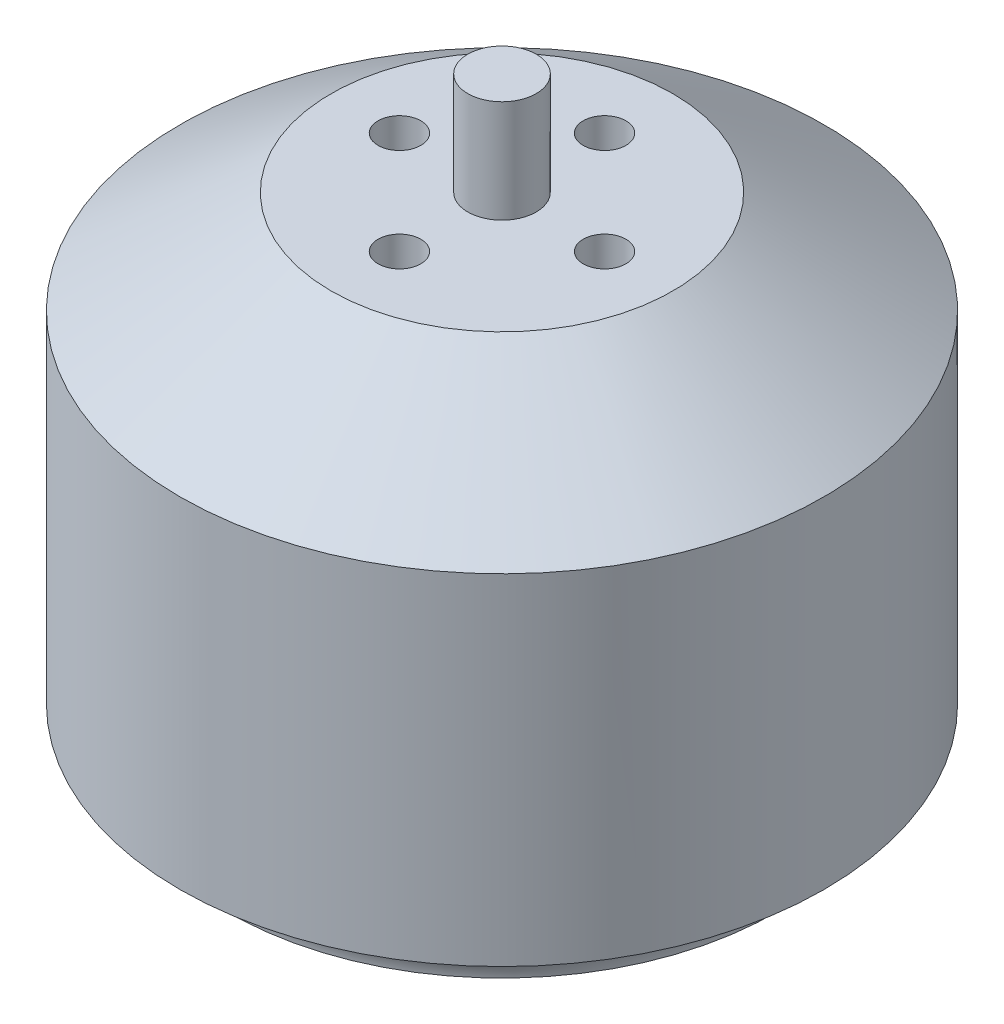
ISO-10303-21;
HEADER;
FILE_DESCRIPTION(('STEP AP214'),'2;1');
FILE_NAME('part.step','',(''),(''),'','','');
FILE_SCHEMA(('AUTOMOTIVE_DESIGN { 1 0 10303 214 1 1 1 1 }'));
ENDSEC;
DATA;
#1=APPLICATION_CONTEXT('core data for automotive mechanical design processes');
#2=APPLICATION_PROTOCOL_DEFINITION('international standard','automotive_design',2000,#1);
#3=PRODUCT_CONTEXT('',#1,'mechanical');
#4=PRODUCT('Part','Part','',(#3));
#5=PRODUCT_RELATED_PRODUCT_CATEGORY('part','',(#4));
#6=PRODUCT_DEFINITION_FORMATION('','',#4);
#7=PRODUCT_DEFINITION_CONTEXT('part definition',#1,'design');
#8=PRODUCT_DEFINITION('design','',#6,#7);
#9=PRODUCT_DEFINITION_SHAPE('','',#8);
#10=(LENGTH_UNIT() NAMED_UNIT(*) SI_UNIT(.MILLI.,.METRE.));
#11=(NAMED_UNIT(*) PLANE_ANGLE_UNIT() SI_UNIT($,.RADIAN.));
#12=(NAMED_UNIT(*) SI_UNIT($,.STERADIAN.) SOLID_ANGLE_UNIT());
#13=UNCERTAINTY_MEASURE_WITH_UNIT(LENGTH_MEASURE(1.E-05),#10,'distance_accuracy_value','');
#14=(GEOMETRIC_REPRESENTATION_CONTEXT(3) GLOBAL_UNCERTAINTY_ASSIGNED_CONTEXT((#13)) GLOBAL_UNIT_ASSIGNED_CONTEXT((#10,
#11,#12)) REPRESENTATION_CONTEXT('',''));
#15=CARTESIAN_POINT('',(0.,0.,0.));
#16=DIRECTION('',(0.,0.,1.));
#17=DIRECTION('',(1.,0.,0.));
#18=AXIS2_PLACEMENT_3D('',#15,#16,#17);
#19=CARTESIAN_POINT('',(0.,0.,0.));
#20=DIRECTION('',(0.,1.,0.));
#21=DIRECTION('',(0.,0.,-1.));
#22=AXIS2_PLACEMENT_3D('',#19,#20,#21);
#23=PLANE('',#22);
#24=CARTESIAN_POINT('',(0.,0.,0.));
#25=DIRECTION('',(0.,-1.,0.));
#26=DIRECTION('',(0.,0.,-1.));
#27=AXIS2_PLACEMENT_3D('',#24,#25,#26);
#28=CIRCLE('',#27,16.);
#29=CARTESIAN_POINT('',(0.,0.,-16.));
#30=VERTEX_POINT('',#29);
#31=EDGE_CURVE('E122',#30,#30,#28,.T.);
#32=ORIENTED_EDGE('',*,*,#31,.T.);
#33=EDGE_LOOP('',(#32));
#34=FACE_BOUND('',#33,.T.);
#35=CARTESIAN_POINT('',(0.,0.,-9.5));
#36=DIRECTION('',(0.,1.,0.));
#37=DIRECTION('',(0.,0.,1.));
#38=AXIS2_PLACEMENT_3D('',#35,#36,#37);
#39=CIRCLE('',#38,1.24999999999999);
#40=CARTESIAN_POINT('',(0.,0.,-8.25000000000001));
#41=VERTEX_POINT('',#40);
#42=EDGE_CURVE('E125',#41,#41,#39,.T.);
#43=ORIENTED_EDGE('',*,*,#42,.T.);
#44=EDGE_LOOP('',(#43));
#45=FACE_BOUND('',#44,.T.);
#46=CARTESIAN_POINT('',(12.5,0.,0.));
#47=DIRECTION('',(0.,1.,0.));
#48=DIRECTION('',(0.,0.,1.));
#49=AXIS2_PLACEMENT_3D('',#46,#47,#48);
#50=CIRCLE('',#49,1.24999999999999);
#51=CARTESIAN_POINT('',(12.5,0.,1.24999999999999));
#52=VERTEX_POINT('',#51);
#53=EDGE_CURVE('E141',#52,#52,#50,.T.);
#54=ORIENTED_EDGE('',*,*,#53,.T.);
#55=EDGE_LOOP('',(#54));
#56=FACE_BOUND('',#55,.T.);
#57=CARTESIAN_POINT('',(0.,0.,9.5));
#58=DIRECTION('',(0.,1.,0.));
#59=DIRECTION('',(0.,0.,1.));
#60=AXIS2_PLACEMENT_3D('',#57,#58,#59);
#61=CIRCLE('',#60,1.24999999999999);
#62=CARTESIAN_POINT('',(0.,0.,10.75));
#63=VERTEX_POINT('',#62);
#64=EDGE_CURVE('E147',#63,#63,#61,.T.);
#65=ORIENTED_EDGE('',*,*,#64,.T.);
#66=EDGE_LOOP('',(#65));
#67=FACE_BOUND('',#66,.T.);
#68=CARTESIAN_POINT('',(-8.,0.,0.));
#69=DIRECTION('',(0.,1.,0.));
#70=DIRECTION('',(0.,0.,1.));
#71=AXIS2_PLACEMENT_3D('',#68,#69,#70);
#72=CIRCLE('',#71,1.24999999999999);
#73=CARTESIAN_POINT('',(-8.,0.,1.24999999999999));
#74=VERTEX_POINT('',#73);
#75=EDGE_CURVE('E153',#74,#74,#72,.T.);
#76=ORIENTED_EDGE('',*,*,#75,.T.);
#77=EDGE_LOOP('',(#76));
#78=FACE_BOUND('',#77,.T.);
#79=CARTESIAN_POINT('',(-12.5,0.,0.));
#80=DIRECTION('',(0.,1.,0.));
#81=DIRECTION('',(0.,0.,1.));
#82=AXIS2_PLACEMENT_3D('',#79,#80,#81);
#83=CIRCLE('',#82,1.24999999999999);
#84=CARTESIAN_POINT('',(-12.5,0.,1.24999999999999));
#85=VERTEX_POINT('',#84);
#86=EDGE_CURVE('E159',#85,#85,#83,.T.);
#87=ORIENTED_EDGE('',*,*,#86,.T.);
#88=EDGE_LOOP('',(#87));
#89=FACE_BOUND('',#88,.T.);
#90=CARTESIAN_POINT('',(0.,0.,0.));
#91=DIRECTION('',(0.,-1.,0.));
#92=DIRECTION('',(0.,0.,-1.));
#93=AXIS2_PLACEMENT_3D('',#90,#91,#92);
#94=CIRCLE('',#93,2.);
#95=CARTESIAN_POINT('',(0.,0.,-2.));
#96=VERTEX_POINT('',#95);
#97=EDGE_CURVE('E11',#96,#96,#94,.F.);
#98=ORIENTED_EDGE('',*,*,#97,.T.);
#99=EDGE_LOOP('',(#98));
#100=FACE_BOUND('',#99,.T.);
#101=CARTESIAN_POINT('',(8.,0.,0.));
#102=DIRECTION('',(0.,1.,0.));
#103=DIRECTION('',(0.,0.,1.));
#104=AXIS2_PLACEMENT_3D('',#101,#102,#103);
#105=CIRCLE('',#104,1.24999999999999);
#106=CARTESIAN_POINT('',(8.,0.,1.24999999999999));
#107=VERTEX_POINT('',#106);
#108=EDGE_CURVE('E135',#107,#107,#105,.T.);
#109=ORIENTED_EDGE('',*,*,#108,.T.);
#110=EDGE_LOOP('',(#109));
#111=FACE_BOUND('',#110,.T.);
#112=ADVANCED_FACE('F45',(#34,#45,#56,#67,#78,#89,#100,#111),#23,.F.);
#113=CARTESIAN_POINT('',(0.,-2.6,0.));
#114=DIRECTION('',(0.,1.,0.));
#115=DIRECTION('',(0.,0.,-1.));
#116=AXIS2_PLACEMENT_3D('',#113,#114,#115);
#117=CYLINDRICAL_SURFACE('',#116,2.);
#118=CARTESIAN_POINT('',(0.,-2.6,0.));
#119=DIRECTION('',(0.,1.,0.));
#120=DIRECTION('',(0.,0.,1.));
#121=AXIS2_PLACEMENT_3D('',#118,#119,#120);
#122=CIRCLE('',#121,2.);
#123=CARTESIAN_POINT('',(0.,-2.6,2.));
#124=VERTEX_POINT('',#123);
#125=EDGE_CURVE('E165',#124,#124,#122,.T.);
#126=ORIENTED_EDGE('',*,*,#125,.T.);
#127=EDGE_LOOP('',(#126));
#128=FACE_BOUND('',#127,.T.);
#129=ORIENTED_EDGE('',*,*,#97,.F.);
#130=EDGE_LOOP('',(#129));
#131=FACE_BOUND('',#130,.T.);
#132=ADVANCED_FACE('F192',(#128,#131),#117,.T.);
#133=CARTESIAN_POINT('',(0.,-2.6,0.));
#134=DIRECTION('',(0.,-1.,0.));
#135=DIRECTION('',(0.,0.,1.));
#136=AXIS2_PLACEMENT_3D('',#133,#134,#135);
#137=PLANE('',#136);
#138=ORIENTED_EDGE('',*,*,#125,.F.);
#139=EDGE_LOOP('',(#138));
#140=FACE_BOUND('',#139,.T.);
#141=ADVANCED_FACE('F197',(#140),#137,.T.);
#142=CARTESIAN_POINT('',(-12.5,1.64892422621555,0.));
#143=DIRECTION('',(0.,-1.,0.));
#144=DIRECTION('',(0.,0.,1.));
#145=AXIS2_PLACEMENT_3D('',#142,#143,#144);
#146=CONICAL_SURFACE('',#145,1.25,1.02974425867665);
#147=CARTESIAN_POINT('',(-12.5,2.4,0.));
#148=VERTEX_POINT('',#147);
#149=VERTEX_LOOP('',#148);
#150=FACE_BOUND('',#149,.T.);
#151=CARTESIAN_POINT('',(-12.5,1.64892422621555,0.));
#152=DIRECTION('',(0.,1.,0.));
#153=DIRECTION('',(0.,0.,1.));
#154=AXIS2_PLACEMENT_3D('',#151,#152,#153);
#155=CIRCLE('',#154,1.25);
#156=CARTESIAN_POINT('',(-12.5,1.64892422621555,1.25));
#157=VERTEX_POINT('',#156);
#158=EDGE_CURVE('E162',#157,#157,#155,.T.);
#159=ORIENTED_EDGE('',*,*,#158,.F.);
#160=EDGE_LOOP('',(#159));
#161=FACE_BOUND('',#160,.T.);
#162=ADVANCED_FACE('F259',(#150,#161),#146,.F.);
#163=CARTESIAN_POINT('',(-12.5,0.,0.));
#164=DIRECTION('',(0.,-1.,0.));
#165=DIRECTION('',(0.,0.,1.));
#166=AXIS2_PLACEMENT_3D('',#163,#164,#165);
#167=CYLINDRICAL_SURFACE('',#166,1.24999999999999);
#168=ORIENTED_EDGE('',*,*,#158,.T.);
#169=EDGE_LOOP('',(#168));
#170=FACE_BOUND('',#169,.T.);
#171=ORIENTED_EDGE('',*,*,#86,.F.);
#172=EDGE_LOOP('',(#171));
#173=FACE_BOUND('',#172,.T.);
#174=ADVANCED_FACE('F256',(#170,#173),#167,.F.);
#175=CARTESIAN_POINT('',(-8.,1.64892422621555,0.));
#176=DIRECTION('',(0.,-1.,0.));
#177=DIRECTION('',(0.,0.,1.));
#178=AXIS2_PLACEMENT_3D('',#175,#176,#177);
#179=CONICAL_SURFACE('',#178,1.25,1.02974425867665);
#180=CARTESIAN_POINT('',(-8.,2.4,0.));
#181=VERTEX_POINT('',#180);
#182=VERTEX_LOOP('',#181);
#183=FACE_BOUND('',#182,.T.);
#184=CARTESIAN_POINT('',(-8.,1.64892422621555,0.));
#185=DIRECTION('',(0.,1.,0.));
#186=DIRECTION('',(0.,0.,1.));
#187=AXIS2_PLACEMENT_3D('',#184,#185,#186);
#188=CIRCLE('',#187,1.25);
#189=CARTESIAN_POINT('',(-8.,1.64892422621555,1.25));
#190=VERTEX_POINT('',#189);
#191=EDGE_CURVE('E156',#190,#190,#188,.T.);
#192=ORIENTED_EDGE('',*,*,#191,.F.);
#193=EDGE_LOOP('',(#192));
#194=FACE_BOUND('',#193,.T.);
#195=ADVANCED_FACE('F252',(#183,#194),#179,.F.);
#196=CARTESIAN_POINT('',(-8.,0.,0.));
#197=DIRECTION('',(0.,-1.,0.));
#198=DIRECTION('',(0.,0.,1.));
#199=AXIS2_PLACEMENT_3D('',#196,#197,#198);
#200=CYLINDRICAL_SURFACE('',#199,1.24999999999999);
#201=ORIENTED_EDGE('',*,*,#191,.T.);
#202=EDGE_LOOP('',(#201));
#203=FACE_BOUND('',#202,.T.);
#204=ORIENTED_EDGE('',*,*,#75,.F.);
#205=EDGE_LOOP('',(#204));
#206=FACE_BOUND('',#205,.T.);
#207=ADVANCED_FACE('F248',(#203,#206),#200,.F.);
#208=CARTESIAN_POINT('',(0.,1.64892422621555,9.5));
#209=DIRECTION('',(0.,-1.,0.));
#210=DIRECTION('',(0.,0.,1.));
#211=AXIS2_PLACEMENT_3D('',#208,#209,#210);
#212=CONICAL_SURFACE('',#211,1.25,1.02974425867665);
#213=CARTESIAN_POINT('',(0.,2.4,9.5));
#214=VERTEX_POINT('',#213);
#215=VERTEX_LOOP('',#214);
#216=FACE_BOUND('',#215,.T.);
#217=CARTESIAN_POINT('',(0.,1.64892422621555,9.5));
#218=DIRECTION('',(0.,1.,0.));
#219=DIRECTION('',(0.,0.,1.));
#220=AXIS2_PLACEMENT_3D('',#217,#218,#219);
#221=CIRCLE('',#220,1.25);
#222=CARTESIAN_POINT('',(0.,1.64892422621555,10.75));
#223=VERTEX_POINT('',#222);
#224=EDGE_CURVE('E150',#223,#223,#221,.T.);
#225=ORIENTED_EDGE('',*,*,#224,.F.);
#226=EDGE_LOOP('',(#225));
#227=FACE_BOUND('',#226,.T.);
#228=ADVANCED_FACE('F244',(#216,#227),#212,.F.);
#229=CARTESIAN_POINT('',(0.,0.,9.5));
#230=DIRECTION('',(0.,-1.,0.));
#231=DIRECTION('',(0.,0.,1.));
#232=AXIS2_PLACEMENT_3D('',#229,#230,#231);
#233=CYLINDRICAL_SURFACE('',#232,1.24999999999999);
#234=ORIENTED_EDGE('',*,*,#224,.T.);
#235=EDGE_LOOP('',(#234));
#236=FACE_BOUND('',#235,.T.);
#237=ORIENTED_EDGE('',*,*,#64,.F.);
#238=EDGE_LOOP('',(#237));
#239=FACE_BOUND('',#238,.T.);
#240=ADVANCED_FACE('F240',(#236,#239),#233,.F.);
#241=CARTESIAN_POINT('',(12.5,1.64892422621555,0.));
#242=DIRECTION('',(0.,-1.,0.));
#243=DIRECTION('',(0.,0.,1.));
#244=AXIS2_PLACEMENT_3D('',#241,#242,#243);
#245=CONICAL_SURFACE('',#244,1.25,1.02974425867665);
#246=CARTESIAN_POINT('',(12.5,2.4,0.));
#247=VERTEX_POINT('',#246);
#248=VERTEX_LOOP('',#247);
#249=FACE_BOUND('',#248,.T.);
#250=CARTESIAN_POINT('',(12.5,1.64892422621555,0.));
#251=DIRECTION('',(0.,1.,0.));
#252=DIRECTION('',(0.,0.,1.));
#253=AXIS2_PLACEMENT_3D('',#250,#251,#252);
#254=CIRCLE('',#253,1.25);
#255=CARTESIAN_POINT('',(12.5,1.64892422621555,1.25));
#256=VERTEX_POINT('',#255);
#257=EDGE_CURVE('E144',#256,#256,#254,.T.);
#258=ORIENTED_EDGE('',*,*,#257,.F.);
#259=EDGE_LOOP('',(#258));
#260=FACE_BOUND('',#259,.T.);
#261=ADVANCED_FACE('F236',(#249,#260),#245,.F.);
#262=CARTESIAN_POINT('',(12.5,0.,0.));
#263=DIRECTION('',(0.,-1.,0.));
#264=DIRECTION('',(0.,0.,1.));
#265=AXIS2_PLACEMENT_3D('',#262,#263,#264);
#266=CYLINDRICAL_SURFACE('',#265,1.24999999999999);
#267=ORIENTED_EDGE('',*,*,#257,.T.);
#268=EDGE_LOOP('',(#267));
#269=FACE_BOUND('',#268,.T.);
#270=ORIENTED_EDGE('',*,*,#53,.F.);
#271=EDGE_LOOP('',(#270));
#272=FACE_BOUND('',#271,.T.);
#273=ADVANCED_FACE('F229',(#269,#272),#266,.F.);
#274=CARTESIAN_POINT('',(8.,1.64892422621555,0.));
#275=DIRECTION('',(0.,-1.,0.));
#276=DIRECTION('',(0.,0.,1.));
#277=AXIS2_PLACEMENT_3D('',#274,#275,#276);
#278=CONICAL_SURFACE('',#277,1.25,1.02974425867665);
#279=CARTESIAN_POINT('',(8.,2.4,0.));
#280=VERTEX_POINT('',#279);
#281=VERTEX_LOOP('',#280);
#282=FACE_BOUND('',#281,.T.);
#283=CARTESIAN_POINT('',(8.,1.64892422621555,0.));
#284=DIRECTION('',(0.,1.,0.));
#285=DIRECTION('',(0.,0.,1.));
#286=AXIS2_PLACEMENT_3D('',#283,#284,#285);
#287=CIRCLE('',#286,1.25);
#288=CARTESIAN_POINT('',(8.,1.64892422621555,1.25));
#289=VERTEX_POINT('',#288);
#290=EDGE_CURVE('E138',#289,#289,#287,.T.);
#291=ORIENTED_EDGE('',*,*,#290,.F.);
#292=EDGE_LOOP('',(#291));
#293=FACE_BOUND('',#292,.T.);
#294=ADVANCED_FACE('F219',(#282,#293),#278,.F.);
#295=CARTESIAN_POINT('',(8.,0.,0.));
#296=DIRECTION('',(0.,-1.,0.));
#297=DIRECTION('',(0.,0.,1.));
#298=AXIS2_PLACEMENT_3D('',#295,#296,#297);
#299=CYLINDRICAL_SURFACE('',#298,1.24999999999999);
#300=ORIENTED_EDGE('',*,*,#290,.T.);
#301=EDGE_LOOP('',(#300));
#302=FACE_BOUND('',#301,.T.);
#303=ORIENTED_EDGE('',*,*,#108,.F.);
#304=EDGE_LOOP('',(#303));
#305=FACE_BOUND('',#304,.T.);
#306=ADVANCED_FACE('F216',(#302,#305),#299,.F.);
#307=CARTESIAN_POINT('',(0.,1.64892422621555,-9.5));
#308=DIRECTION('',(0.,-1.,0.));
#309=DIRECTION('',(0.,0.,1.));
#310=AXIS2_PLACEMENT_3D('',#307,#308,#309);
#311=CONICAL_SURFACE('',#310,1.25,1.02974425867665);
#312=CARTESIAN_POINT('',(0.,2.4,-9.5));
#313=VERTEX_POINT('',#312);
#314=VERTEX_LOOP('',#313);
#315=FACE_BOUND('',#314,.T.);
#316=CARTESIAN_POINT('',(0.,1.64892422621555,-9.5));
#317=DIRECTION('',(0.,1.,0.));
#318=DIRECTION('',(0.,0.,1.));
#319=AXIS2_PLACEMENT_3D('',#316,#317,#318);
#320=CIRCLE('',#319,1.25);
#321=CARTESIAN_POINT('',(0.,1.64892422621555,-8.25));
#322=VERTEX_POINT('',#321);
#323=EDGE_CURVE('E132',#322,#322,#320,.T.);
#324=ORIENTED_EDGE('',*,*,#323,.F.);
#325=EDGE_LOOP('',(#324));
#326=FACE_BOUND('',#325,.T.);
#327=ADVANCED_FACE('F218',(#315,#326),#311,.F.);
#328=CARTESIAN_POINT('',(0.,0.,-9.5));
#329=DIRECTION('',(0.,-1.,0.));
#330=DIRECTION('',(0.,0.,1.));
#331=AXIS2_PLACEMENT_3D('',#328,#329,#330);
#332=CYLINDRICAL_SURFACE('',#331,1.24999999999999);
#333=ORIENTED_EDGE('',*,*,#323,.T.);
#334=EDGE_LOOP('',(#333));
#335=FACE_BOUND('',#334,.T.);
#336=ORIENTED_EDGE('',*,*,#42,.F.);
#337=EDGE_LOOP('',(#336));
#338=FACE_BOUND('',#337,.T.);
#339=ADVANCED_FACE('F226',(#335,#338),#332,.F.);
#340=CARTESIAN_POINT('',(0.,-0.262019230769191,0.));
#341=DIRECTION('',(0.,1.,0.));
#342=DIRECTION('',(0.,0.,-1.));
#343=AXIS2_PLACEMENT_3D('',#340,#341,#342);
#344=TOROIDAL_SURFACE('',#343,18.85,2.8620192307692);
#345=CARTESIAN_POINT('',(0.,2.60000000000002,0.));
#346=DIRECTION('',(0.,-1.,0.));
#347=DIRECTION('',(0.,0.,-1.));
#348=AXIS2_PLACEMENT_3D('',#345,#346,#347);
#349=CIRCLE('',#348,18.85);
#350=CARTESIAN_POINT('',(0.,2.60000000000002,18.85));
#351=VERTEX_POINT('',#350);
#352=EDGE_CURVE('E117',#351,#351,#349,.T.);
#353=ORIENTED_EDGE('',*,*,#352,.T.);
#354=EDGE_LOOP('',(#353));
#355=FACE_BOUND('',#354,.T.);
#356=ORIENTED_EDGE('',*,*,#31,.F.);
#357=EDGE_LOOP('',(#356));
#358=FACE_BOUND('',#357,.T.);
#359=ADVANCED_FACE('F340',(#355,#358),#344,.F.);
#360=CARTESIAN_POINT('',(0.,28.5,0.));
#361=DIRECTION('',(0.,-1.,0.));
#362=DIRECTION('',(0.,0.,1.));
#363=AXIS2_PLACEMENT_3D('',#360,#361,#362);
#364=CYLINDRICAL_SURFACE('',#363,18.85);
#365=CARTESIAN_POINT('',(0.,22.5,0.));
#366=DIRECTION('',(0.,-1.,0.));
#367=DIRECTION('',(0.,0.,-1.));
#368=AXIS2_PLACEMENT_3D('',#365,#366,#367);
#369=CIRCLE('',#368,18.85);
#370=CARTESIAN_POINT('',(0.,22.5,18.85));
#371=VERTEX_POINT('',#370);
#372=EDGE_CURVE('E118',#371,#371,#369,.T.);
#373=CARTESIAN_POINT('',(0.,22.5,18.85));
#374=CARTESIAN_POINT('',(0.,22.2927083333333,18.85));
#375=CARTESIAN_POINT('',(0.,22.0854166666667,18.85));
#376=CARTESIAN_POINT('',(0.,21.6708333333333,18.85));
#377=CARTESIAN_POINT('',(0.,21.4635416666667,18.85));
#378=CARTESIAN_POINT('',(0.,21.0489583333333,18.85));
#379=CARTESIAN_POINT('',(0.,20.8416666666667,18.85));
#380=CARTESIAN_POINT('',(0.,20.4270833333333,18.85));
#381=CARTESIAN_POINT('',(0.,20.2197916666667,18.85));
#382=CARTESIAN_POINT('',(0.,19.8052083333333,18.85));
#383=CARTESIAN_POINT('',(0.,19.5979166666667,18.85));
#384=CARTESIAN_POINT('',(0.,19.1833333333333,18.85));
#385=CARTESIAN_POINT('',(0.,18.9760416666667,18.85));
#386=CARTESIAN_POINT('',(0.,18.5614583333333,18.85));
#387=CARTESIAN_POINT('',(0.,18.3541666666667,18.85));
#388=CARTESIAN_POINT('',(0.,17.9395833333333,18.85));
#389=CARTESIAN_POINT('',(0.,17.7322916666667,18.85));
#390=CARTESIAN_POINT('',(0.,17.3177083333333,18.85));
#391=CARTESIAN_POINT('',(0.,17.1104166666667,18.85));
#392=CARTESIAN_POINT('',(0.,16.6958333333333,18.85));
#393=CARTESIAN_POINT('',(0.,16.4885416666667,18.85));
#394=CARTESIAN_POINT('',(0.,16.0739583333333,18.85));
#395=CARTESIAN_POINT('',(0.,15.8666666666667,18.85));
#396=CARTESIAN_POINT('',(0.,15.4520833333333,18.85));
#397=CARTESIAN_POINT('',(0.,15.2447916666667,18.85));
#398=CARTESIAN_POINT('',(0.,14.8302083333333,18.85));
#399=CARTESIAN_POINT('',(0.,14.6229166666667,18.85));
#400=CARTESIAN_POINT('',(0.,14.2083333333333,18.85));
#401=CARTESIAN_POINT('',(0.,14.0010416666667,18.85));
#402=CARTESIAN_POINT('',(0.,13.5864583333333,18.85));
#403=CARTESIAN_POINT('',(0.,13.3791666666667,18.85));
#404=CARTESIAN_POINT('',(0.,12.9645833333333,18.85));
#405=CARTESIAN_POINT('',(0.,12.7572916666667,18.85));
#406=CARTESIAN_POINT('',(0.,12.3427083333333,18.85));
#407=CARTESIAN_POINT('',(0.,12.1354166666667,18.85));
#408=CARTESIAN_POINT('',(0.,11.7208333333333,18.85));
#409=CARTESIAN_POINT('',(0.,11.5135416666667,18.85));
#410=CARTESIAN_POINT('',(0.,11.0989583333333,18.85));
#411=CARTESIAN_POINT('',(0.,10.8916666666667,18.85));
#412=CARTESIAN_POINT('',(0.,10.4770833333333,18.85));
#413=CARTESIAN_POINT('',(0.,10.2697916666667,18.85));
#414=CARTESIAN_POINT('',(0.,9.85520833333335,18.85));
#415=CARTESIAN_POINT('',(0.,9.64791666666668,18.85));
#416=CARTESIAN_POINT('',(0.,9.23333333333335,18.85));
#417=CARTESIAN_POINT('',(0.,9.02604166666668,18.85));
#418=CARTESIAN_POINT('',(0.,8.61145833333335,18.85));
#419=CARTESIAN_POINT('',(0.,8.40416666666668,18.85));
#420=CARTESIAN_POINT('',(0.,7.98958333333335,18.85));
#421=CARTESIAN_POINT('',(0.,7.78229166666668,18.85));
#422=CARTESIAN_POINT('',(0.,7.36770833333335,18.85));
#423=CARTESIAN_POINT('',(0.,7.16041666666668,18.85));
#424=CARTESIAN_POINT('',(0.,6.74583333333335,18.85));
#425=CARTESIAN_POINT('',(0.,6.53854166666668,18.85));
#426=CARTESIAN_POINT('',(0.,6.12395833333335,18.85));
#427=CARTESIAN_POINT('',(0.,5.91666666666668,18.85));
#428=CARTESIAN_POINT('',(0.,5.50208333333335,18.85));
#429=CARTESIAN_POINT('',(0.,5.29479166666668,18.85));
#430=CARTESIAN_POINT('',(0.,4.88020833333335,18.85));
#431=CARTESIAN_POINT('',(0.,4.67291666666668,18.85));
#432=CARTESIAN_POINT('',(0.,4.25833333333335,18.85));
#433=CARTESIAN_POINT('',(0.,4.05104166666668,18.85));
#434=CARTESIAN_POINT('',(0.,3.63645833333335,18.85));
#435=CARTESIAN_POINT('',(0.,3.42916666666668,18.85));
#436=CARTESIAN_POINT('',(0.,3.01458333333335,18.85));
#437=CARTESIAN_POINT('',(0.,2.80729166666669,18.85));
#438=CARTESIAN_POINT('',(0.,2.60000000000002,18.85));
#439=B_SPLINE_CURVE_WITH_KNOTS('',3,(#373,#374,#375,#376,#377,#378,#379,#380,#381,#382,#383,
#384,#385,#386,#387,#388,#389,#390,#391,#392,#393,#394,#395,#396,#397,#398,#399,#400,#401,#402,
#403,#404,#405,#406,#407,#408,#409,#410,#411,#412,#413,#414,#415,#416,#417,#418,#419,#420,#421,
#422,#423,#424,#425,#426,#427,#428,#429,#430,#431,#432,#433,#434,#435,#436,#437,#438),
.UNSPECIFIED.,.F.,.F.,(4,2,2,2,2,2,2,2,2,2,2,2,2,2,2,2,2,2,2,2,2,2,2,2,2,2,2,2,2,2,2,2,4),(0.,
0.621875000000001,1.24375,1.865625,2.4875,3.109375,3.73124999999999,4.353125,4.975,5.596875,
6.21875,6.840625,7.4625,8.08437499999999,8.70625,9.32812499999999,9.94999999999999,10.571875,
11.19375,11.815625,12.4375,13.059375,13.68125,14.303125,14.925,15.546875,16.16875,16.790625,
17.4125,18.034375,18.65625,19.278125,19.9),.UNSPECIFIED.);
#440=EDGE_CURVE('BSEAM47',#371,#351,#439,.T.);
#441=ORIENTED_EDGE('',*,*,#372,.T.);
#442=ORIENTED_EDGE('',*,*,#352,.F.);
#443=ORIENTED_EDGE('',*,*,#440,.T.);
#444=ORIENTED_EDGE('',*,*,#440,.F.);
#445=EDGE_LOOP('',(#441,#443,#442,#444));
#446=FACE_BOUND('',#445,.T.);
#447=ADVANCED_FACE('F47',(#446),#364,.T.);
#448=CARTESIAN_POINT('',(0.,22.5,0.));
#449=DIRECTION('',(0.,-1.,0.));
#450=DIRECTION('',(0.,0.,1.));
#451=AXIS2_PLACEMENT_3D('',#448,#449,#450);
#452=CONICAL_SURFACE('',#451,18.85,0.975011779171836);
#453=CARTESIAN_POINT('',(0.,28.5,0.));
#454=DIRECTION('',(0.,-1.,0.));
#455=DIRECTION('',(0.,0.,-1.));
#456=AXIS2_PLACEMENT_3D('',#453,#454,#455);
#457=CIRCLE('',#456,10.);
#458=CARTESIAN_POINT('',(0.,28.5,-10.));
#459=VERTEX_POINT('',#458);
#460=EDGE_CURVE('E121',#459,#459,#457,.T.);
#461=ORIENTED_EDGE('',*,*,#460,.T.);
#462=EDGE_LOOP('',(#461));
#463=FACE_BOUND('',#462,.T.);
#464=ORIENTED_EDGE('',*,*,#372,.F.);
#465=EDGE_LOOP('',(#464));
#466=FACE_BOUND('',#465,.T.);
#467=ADVANCED_FACE('F188',(#463,#466),#452,.T.);
#468=CARTESIAN_POINT('',(0.,34.5,0.));
#469=DIRECTION('',(0.,1.,0.));
#470=DIRECTION('',(0.,0.,-1.));
#471=AXIS2_PLACEMENT_3D('',#468,#469,#470);
#472=PLANE('',#471);
#473=CARTESIAN_POINT('',(0.,34.5,0.));
#474=DIRECTION('',(0.,-1.,0.));
#475=DIRECTION('',(0.,0.,-1.));
#476=AXIS2_PLACEMENT_3D('',#473,#474,#475);
#477=CIRCLE('',#476,2.);
#478=CARTESIAN_POINT('',(0.,34.5,-2.));
#479=VERTEX_POINT('',#478);
#480=EDGE_CURVE('E53',#479,#479,#477,.T.);
#481=ORIENTED_EDGE('',*,*,#480,.F.);
#482=EDGE_LOOP('',(#481));
#483=FACE_BOUND('',#482,.T.);
#484=ADVANCED_FACE('F178',(#483),#472,.T.);
#485=CARTESIAN_POINT('',(0.,34.5,0.));
#486=DIRECTION('',(0.,-1.,0.));
#487=DIRECTION('',(0.,0.,1.));
#488=AXIS2_PLACEMENT_3D('',#485,#486,#487);
#489=CYLINDRICAL_SURFACE('',#488,2.);
#490=ORIENTED_EDGE('',*,*,#480,.T.);
#491=EDGE_LOOP('',(#490));
#492=FACE_BOUND('',#491,.T.);
#493=CARTESIAN_POINT('',(0.,28.5,0.));
#494=DIRECTION('',(0.,-1.,0.));
#495=DIRECTION('',(0.,0.,-1.));
#496=AXIS2_PLACEMENT_3D('',#493,#494,#495);
#497=CIRCLE('',#496,2.);
#498=CARTESIAN_POINT('',(0.,28.5,-2.));
#499=VERTEX_POINT('',#498);
#500=EDGE_CURVE('E168',#499,#499,#497,.T.);
#501=ORIENTED_EDGE('',*,*,#500,.F.);
#502=EDGE_LOOP('',(#501));
#503=FACE_BOUND('',#502,.T.);
#504=ADVANCED_FACE('F176',(#492,#503),#489,.T.);
#505=CARTESIAN_POINT('',(0.,28.5,0.));
#506=DIRECTION('',(0.,1.,0.));
#507=DIRECTION('',(0.,0.,-1.));
#508=AXIS2_PLACEMENT_3D('',#505,#506,#507);
#509=PLANE('',#508);
#510=CARTESIAN_POINT('',(0.,28.5,6.));
#511=DIRECTION('',(0.,-1.,0.));
#512=DIRECTION('',(0.,0.,-1.));
#513=AXIS2_PLACEMENT_3D('',#510,#511,#512);
#514=CIRCLE('',#513,1.24999999999999);
#515=CARTESIAN_POINT('',(0.,28.5,4.75000000000001));
#516=VERTEX_POINT('',#515);
#517=EDGE_CURVE('E95',#516,#516,#514,.T.);
#518=ORIENTED_EDGE('',*,*,#517,.T.);
#519=EDGE_LOOP('',(#518));
#520=FACE_BOUND('',#519,.T.);
#521=CARTESIAN_POINT('',(6.,28.5,0.));
#522=DIRECTION('',(0.,-1.,0.));
#523=DIRECTION('',(0.,0.,-1.));
#524=AXIS2_PLACEMENT_3D('',#521,#522,#523);
#525=CIRCLE('',#524,1.24999999999999);
#526=CARTESIAN_POINT('',(6.,28.5,-1.25000000000001));
#527=VERTEX_POINT('',#526);
#528=EDGE_CURVE('E94',#527,#527,#525,.T.);
#529=ORIENTED_EDGE('',*,*,#528,.T.);
#530=EDGE_LOOP('',(#529));
#531=FACE_BOUND('',#530,.T.);
#532=CARTESIAN_POINT('',(0.,28.5,-5.99999999999994));
#533=DIRECTION('',(0.,-1.,0.));
#534=DIRECTION('',(0.,0.,-1.));
#535=AXIS2_PLACEMENT_3D('',#532,#533,#534);
#536=CIRCLE('',#535,1.24999999999999);
#537=CARTESIAN_POINT('',(0.,28.5,-7.24999999999993));
#538=VERTEX_POINT('',#537);
#539=EDGE_CURVE('E105',#538,#538,#536,.T.);
#540=ORIENTED_EDGE('',*,*,#539,.T.);
#541=EDGE_LOOP('',(#540));
#542=FACE_BOUND('',#541,.T.);
#543=CARTESIAN_POINT('',(-6.,28.5,0.));
#544=DIRECTION('',(0.,-1.,0.));
#545=DIRECTION('',(0.,0.,-1.));
#546=AXIS2_PLACEMENT_3D('',#543,#544,#545);
#547=CIRCLE('',#546,1.24999999999999);
#548=CARTESIAN_POINT('',(-6.,28.5,-1.24999999999993));
#549=VERTEX_POINT('',#548);
#550=EDGE_CURVE('E111',#549,#549,#547,.T.);
#551=ORIENTED_EDGE('',*,*,#550,.T.);
#552=EDGE_LOOP('',(#551));
#553=FACE_BOUND('',#552,.T.);
#554=ORIENTED_EDGE('',*,*,#500,.T.);
#555=EDGE_LOOP('',(#554));
#556=FACE_BOUND('',#555,.T.);
#557=ORIENTED_EDGE('',*,*,#460,.F.);
#558=EDGE_LOOP('',(#557));
#559=FACE_BOUND('',#558,.T.);
#560=ADVANCED_FACE('F173',(#520,#531,#542,#553,#556,#559),#509,.T.);
#561=CARTESIAN_POINT('',(-6.,23.2510757737845,0.));
#562=DIRECTION('',(0.,1.,0.));
#563=DIRECTION('',(0.,0.,-1.));
#564=AXIS2_PLACEMENT_3D('',#561,#562,#563);
#565=CONICAL_SURFACE('',#564,1.25,1.02974425867665);
#566=CARTESIAN_POINT('',(-6.,22.5,0.));
#567=VERTEX_POINT('',#566);
#568=VERTEX_LOOP('',#567);
#569=FACE_BOUND('',#568,.T.);
#570=CARTESIAN_POINT('',(-6.,23.2510757737845,0.));
#571=DIRECTION('',(0.,-1.,0.));
#572=DIRECTION('',(0.,0.,-1.));
#573=AXIS2_PLACEMENT_3D('',#570,#571,#572);
#574=CIRCLE('',#573,1.25);
#575=CARTESIAN_POINT('',(-6.,23.2510757737845,-1.24999999999994));
#576=VERTEX_POINT('',#575);
#577=EDGE_CURVE('E114',#576,#576,#574,.T.);
#578=ORIENTED_EDGE('',*,*,#577,.F.);
#579=EDGE_LOOP('',(#578));
#580=FACE_BOUND('',#579,.T.);
#581=ADVANCED_FACE('F185',(#569,#580),#565,.F.);
#582=CARTESIAN_POINT('',(-6.,28.5,0.));
#583=DIRECTION('',(0.,1.,0.));
#584=DIRECTION('',(0.,0.,-1.));
#585=AXIS2_PLACEMENT_3D('',#582,#583,#584);
#586=CYLINDRICAL_SURFACE('',#585,1.24999999999999);
#587=ORIENTED_EDGE('',*,*,#577,.T.);
#588=EDGE_LOOP('',(#587));
#589=FACE_BOUND('',#588,.T.);
#590=ORIENTED_EDGE('',*,*,#550,.F.);
#591=EDGE_LOOP('',(#590));
#592=FACE_BOUND('',#591,.T.);
#593=ADVANCED_FACE('F402',(#589,#592),#586,.F.);
#594=CARTESIAN_POINT('',(0.,23.2510757737845,-5.99999999999994));
#595=DIRECTION('',(0.,1.,0.));
#596=DIRECTION('',(0.,0.,-1.));
#597=AXIS2_PLACEMENT_3D('',#594,#595,#596);
#598=CONICAL_SURFACE('',#597,1.25,1.02974425867665);
#599=CARTESIAN_POINT('',(0.,22.5,-5.99999999999994));
#600=VERTEX_POINT('',#599);
#601=VERTEX_LOOP('',#600);
#602=FACE_BOUND('',#601,.T.);
#603=CARTESIAN_POINT('',(0.,23.2510757737845,-5.99999999999994));
#604=DIRECTION('',(0.,-1.,0.));
#605=DIRECTION('',(0.,0.,-1.));
#606=AXIS2_PLACEMENT_3D('',#603,#604,#605);
#607=CIRCLE('',#606,1.25);
#608=CARTESIAN_POINT('',(0.,23.2510757737845,-7.24999999999994));
#609=VERTEX_POINT('',#608);
#610=EDGE_CURVE('E108',#609,#609,#607,.T.);
#611=ORIENTED_EDGE('',*,*,#610,.F.);
#612=EDGE_LOOP('',(#611));
#613=FACE_BOUND('',#612,.T.);
#614=ADVANCED_FACE('F413',(#602,#613),#598,.F.);
#615=CARTESIAN_POINT('',(0.,28.5,-5.99999999999994));
#616=DIRECTION('',(0.,1.,0.));
#617=DIRECTION('',(0.,0.,-1.));
#618=AXIS2_PLACEMENT_3D('',#615,#616,#617);
#619=CYLINDRICAL_SURFACE('',#618,1.24999999999999);
#620=ORIENTED_EDGE('',*,*,#610,.T.);
#621=EDGE_LOOP('',(#620));
#622=FACE_BOUND('',#621,.T.);
#623=ORIENTED_EDGE('',*,*,#539,.F.);
#624=EDGE_LOOP('',(#623));
#625=FACE_BOUND('',#624,.T.);
#626=ADVANCED_FACE('F425',(#622,#625),#619,.F.);
#627=CARTESIAN_POINT('',(6.,23.2510757737845,0.));
#628=DIRECTION('',(0.,1.,0.));
#629=DIRECTION('',(0.,0.,-1.));
#630=AXIS2_PLACEMENT_3D('',#627,#628,#629);
#631=CONICAL_SURFACE('',#630,1.25,1.02974425867665);
#632=CARTESIAN_POINT('',(6.,22.5,0.));
#633=VERTEX_POINT('',#632);
#634=VERTEX_LOOP('',#633);
#635=FACE_BOUND('',#634,.T.);
#636=CARTESIAN_POINT('',(6.,23.2510757737845,0.));
#637=DIRECTION('',(0.,-1.,0.));
#638=DIRECTION('',(0.,0.,-1.));
#639=AXIS2_PLACEMENT_3D('',#636,#637,#638);
#640=CIRCLE('',#639,1.25);
#641=CARTESIAN_POINT('',(6.,23.2510757737845,-1.25000000000002));
#642=VERTEX_POINT('',#641);
#643=EDGE_CURVE('E98',#642,#642,#640,.T.);
#644=ORIENTED_EDGE('',*,*,#643,.F.);
#645=EDGE_LOOP('',(#644));
#646=FACE_BOUND('',#645,.T.);
#647=ADVANCED_FACE('F436',(#635,#646),#631,.F.);
#648=CARTESIAN_POINT('',(6.,28.5,0.));
#649=DIRECTION('',(0.,1.,0.));
#650=DIRECTION('',(0.,0.,-1.));
#651=AXIS2_PLACEMENT_3D('',#648,#649,#650);
#652=CYLINDRICAL_SURFACE('',#651,1.24999999999999);
#653=ORIENTED_EDGE('',*,*,#643,.T.);
#654=EDGE_LOOP('',(#653));
#655=FACE_BOUND('',#654,.T.);
#656=ORIENTED_EDGE('',*,*,#528,.F.);
#657=EDGE_LOOP('',(#656));
#658=FACE_BOUND('',#657,.T.);
#659=ADVANCED_FACE('F88',(#655,#658),#652,.F.);
#660=CARTESIAN_POINT('',(0.,23.2510757737845,6.));
#661=DIRECTION('',(0.,1.,0.));
#662=DIRECTION('',(0.,0.,-1.));
#663=AXIS2_PLACEMENT_3D('',#660,#661,#662);
#664=CONICAL_SURFACE('',#663,1.25,1.02974425867665);
#665=CARTESIAN_POINT('',(0.,22.5,6.));
#666=VERTEX_POINT('',#665);
#667=VERTEX_LOOP('',#666);
#668=FACE_BOUND('',#667,.T.);
#669=CARTESIAN_POINT('',(0.,23.2510757737845,6.));
#670=DIRECTION('',(0.,-1.,0.));
#671=DIRECTION('',(0.,0.,-1.));
#672=AXIS2_PLACEMENT_3D('',#669,#670,#671);
#673=CIRCLE('',#672,1.25);
#674=CARTESIAN_POINT('',(0.,23.2510757737845,4.75));
#675=VERTEX_POINT('',#674);
#676=EDGE_CURVE('E92',#675,#675,#673,.T.);
#677=ORIENTED_EDGE('',*,*,#676,.F.);
#678=EDGE_LOOP('',(#677));
#679=FACE_BOUND('',#678,.T.);
#680=ADVANCED_FACE('F84',(#668,#679),#664,.F.);
#681=CARTESIAN_POINT('',(0.,28.5,6.));
#682=DIRECTION('',(0.,1.,0.));
#683=DIRECTION('',(0.,0.,-1.));
#684=AXIS2_PLACEMENT_3D('',#681,#682,#683);
#685=CYLINDRICAL_SURFACE('',#684,1.24999999999999);
#686=ORIENTED_EDGE('',*,*,#676,.T.);
#687=EDGE_LOOP('',(#686));
#688=FACE_BOUND('',#687,.T.);
#689=ORIENTED_EDGE('',*,*,#517,.F.);
#690=EDGE_LOOP('',(#689));
#691=FACE_BOUND('',#690,.T.);
#692=ADVANCED_FACE('F87',(#688,#691),#685,.F.);
#693=CLOSED_SHELL('',(#112,#132,#141,#162,#174,#195,#207,#228,#240,#261,#273,#294,#306,#327,
#339,#359,#447,#467,#484,#504,#560,#581,#593,#614,#626,#647,#659,#680,#692));
#694=MANIFOLD_SOLID_BREP('B2',#693);
#695=ADVANCED_BREP_SHAPE_REPRESENTATION('',(#18,#694),#14);
#696=SHAPE_DEFINITION_REPRESENTATION(#9,#695);
ENDSEC;
END-ISO-10303-21;
